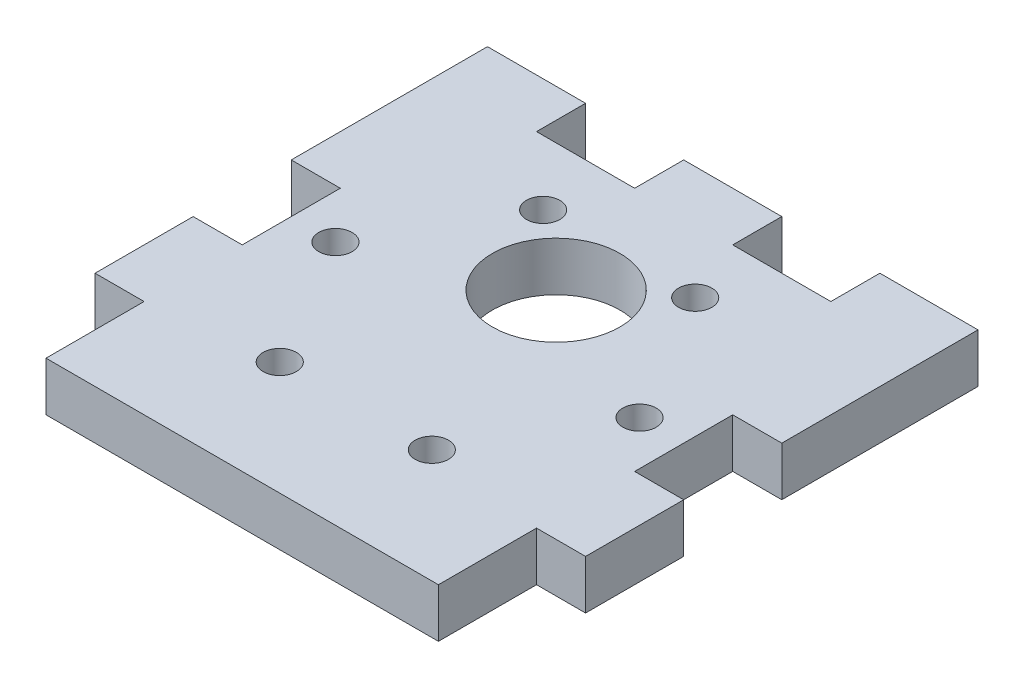
ISO-10303-21;
HEADER;
FILE_DESCRIPTION(('STEP AP214'),'2;1');
FILE_NAME('part.step','',(''),(''),'','','');
FILE_SCHEMA(('AUTOMOTIVE_DESIGN { 1 0 10303 214 1 1 1 1 }'));
ENDSEC;
DATA;
#1=APPLICATION_CONTEXT('core data for automotive mechanical design processes');
#2=APPLICATION_PROTOCOL_DEFINITION('international standard','automotive_design',2000,#1);
#3=PRODUCT_CONTEXT('',#1,'mechanical');
#4=PRODUCT('Part','Part','',(#3));
#5=PRODUCT_RELATED_PRODUCT_CATEGORY('part','',(#4));
#6=PRODUCT_DEFINITION_FORMATION('','',#4);
#7=PRODUCT_DEFINITION_CONTEXT('part definition',#1,'design');
#8=PRODUCT_DEFINITION('design','',#6,#7);
#9=PRODUCT_DEFINITION_SHAPE('','',#8);
#10=(LENGTH_UNIT() NAMED_UNIT(*) SI_UNIT(.MILLI.,.METRE.));
#11=(NAMED_UNIT(*) PLANE_ANGLE_UNIT() SI_UNIT($,.RADIAN.));
#12=(NAMED_UNIT(*) SI_UNIT($,.STERADIAN.) SOLID_ANGLE_UNIT());
#13=UNCERTAINTY_MEASURE_WITH_UNIT(LENGTH_MEASURE(1.E-05),#10,'distance_accuracy_value','');
#14=(GEOMETRIC_REPRESENTATION_CONTEXT(3) GLOBAL_UNCERTAINTY_ASSIGNED_CONTEXT((#13)) GLOBAL_UNIT_ASSIGNED_CONTEXT((#10,
#11,#12)) REPRESENTATION_CONTEXT('',''));
#15=CARTESIAN_POINT('',(0.,0.,0.));
#16=DIRECTION('',(0.,0.,1.));
#17=DIRECTION('',(1.,0.,0.));
#18=AXIS2_PLACEMENT_3D('',#15,#16,#17);
#19=CARTESIAN_POINT('',(25.,5.,25.));
#20=DIRECTION('',(-1.,0.,0.));
#21=DIRECTION('',(0.,0.,1.));
#22=AXIS2_PLACEMENT_3D('',#19,#20,#21);
#23=PLANE('',#22);
#24=DIRECTION('',(0.,0.,-1.));
#25=VECTOR('',#24,1.);
#26=CARTESIAN_POINT('',(25.,0.,25.));
#27=LINE('',#26,#25);
#28=CARTESIAN_POINT('',(25.,0.,15.));
#29=VERTEX_POINT('',#28);
#30=CARTESIAN_POINT('',(25.,0.,5.));
#31=VERTEX_POINT('',#30);
#32=EDGE_CURVE('E403',#29,#31,#27,.T.);
#33=ORIENTED_EDGE('',*,*,#32,.T.);
#34=DIRECTION('',(0.,1.,0.));
#35=VECTOR('',#34,1.);
#36=CARTESIAN_POINT('',(25.,0.,5.));
#37=LINE('',#36,#35);
#38=CARTESIAN_POINT('',(25.,5.,5.));
#39=VERTEX_POINT('',#38);
#40=EDGE_CURVE('E226',#31,#39,#37,.T.);
#41=ORIENTED_EDGE('',*,*,#40,.T.);
#42=DIRECTION('',(0.,0.,-1.));
#43=VECTOR('',#42,1.);
#44=CARTESIAN_POINT('',(25.,5.,25.));
#45=LINE('',#44,#43);
#46=CARTESIAN_POINT('',(25.,5.,15.));
#47=VERTEX_POINT('',#46);
#48=EDGE_CURVE('E387',#47,#39,#45,.T.);
#49=ORIENTED_EDGE('',*,*,#48,.F.);
#50=DIRECTION('',(0.,1.,0.));
#51=VECTOR('',#50,1.);
#52=CARTESIAN_POINT('',(25.,0.,15.));
#53=LINE('',#52,#51);
#54=EDGE_CURVE('E238',#29,#47,#53,.T.);
#55=ORIENTED_EDGE('',*,*,#54,.F.);
#56=EDGE_LOOP('',(#33,#41,#49,#55));
#57=FACE_BOUND('',#56,.T.);
#58=ADVANCED_FACE('F35',(#57),#23,.F.);
#59=CARTESIAN_POINT('',(-25.,5.,25.));
#60=DIRECTION('',(1.,0.,0.));
#61=DIRECTION('',(0.,0.,-1.));
#62=AXIS2_PLACEMENT_3D('',#59,#60,#61);
#63=PLANE('',#62);
#64=DIRECTION('',(0.,0.,1.));
#65=VECTOR('',#64,1.);
#66=CARTESIAN_POINT('',(-25.,0.,25.));
#67=LINE('',#66,#65);
#68=CARTESIAN_POINT('',(-25.,0.,-25.));
#69=VERTEX_POINT('',#68);
#70=CARTESIAN_POINT('',(-25.,0.,-4.99999999999999));
#71=VERTEX_POINT('',#70);
#72=EDGE_CURVE('E412',#69,#71,#67,.T.);
#73=ORIENTED_EDGE('',*,*,#72,.T.);
#74=DIRECTION('',(0.,1.,0.));
#75=VECTOR('',#74,1.);
#76=CARTESIAN_POINT('',(-25.,0.,-4.99999999999999));
#77=LINE('',#76,#75);
#78=CARTESIAN_POINT('',(-25.,5.,-4.99999999999999));
#79=VERTEX_POINT('',#78);
#80=EDGE_CURVE('E265',#71,#79,#77,.T.);
#81=ORIENTED_EDGE('',*,*,#80,.T.);
#82=DIRECTION('',(0.,0.,1.));
#83=VECTOR('',#82,1.);
#84=CARTESIAN_POINT('',(-25.,5.,25.));
#85=LINE('',#84,#83);
#86=CARTESIAN_POINT('',(-25.,5.,-25.));
#87=VERTEX_POINT('',#86);
#88=EDGE_CURVE('E397',#87,#79,#85,.T.);
#89=ORIENTED_EDGE('',*,*,#88,.F.);
#90=DIRECTION('',(0.,-1.,0.));
#91=VECTOR('',#90,1.);
#92=CARTESIAN_POINT('',(-25.,5.,-25.));
#93=LINE('',#92,#91);
#94=EDGE_CURVE('E43',#87,#69,#93,.T.);
#95=ORIENTED_EDGE('',*,*,#94,.T.);
#96=EDGE_LOOP('',(#73,#81,#89,#95));
#97=FACE_BOUND('',#96,.T.);
#98=ADVANCED_FACE('F422',(#97),#63,.F.);
#99=CARTESIAN_POINT('',(-25.,5.,-25.));
#100=DIRECTION('',(0.,0.,1.));
#101=DIRECTION('',(1.,0.,0.));
#102=AXIS2_PLACEMENT_3D('',#99,#100,#101);
#103=PLANE('',#102);
#104=DIRECTION('',(-1.,0.,0.));
#105=VECTOR('',#104,1.);
#106=CARTESIAN_POINT('',(-25.,5.,-25.));
#107=LINE('',#106,#105);
#108=CARTESIAN_POINT('',(5.,5.,-25.));
#109=VERTEX_POINT('',#108);
#110=CARTESIAN_POINT('',(-5.,5.,-25.));
#111=VERTEX_POINT('',#110);
#112=EDGE_CURVE('E396',#109,#111,#107,.T.);
#113=ORIENTED_EDGE('',*,*,#112,.F.);
#114=DIRECTION('',(0.,1.,0.));
#115=VECTOR('',#114,1.);
#116=CARTESIAN_POINT('',(5.,0.,-25.));
#117=LINE('',#116,#115);
#118=CARTESIAN_POINT('',(5.,0.,-25.));
#119=VERTEX_POINT('',#118);
#120=EDGE_CURVE('E310',#119,#109,#117,.T.);
#121=ORIENTED_EDGE('',*,*,#120,.F.);
#122=DIRECTION('',(-1.,0.,0.));
#123=VECTOR('',#122,1.);
#124=CARTESIAN_POINT('',(-25.,0.,-25.));
#125=LINE('',#124,#123);
#126=CARTESIAN_POINT('',(-5.,0.,-25.));
#127=VERTEX_POINT('',#126);
#128=EDGE_CURVE('E411',#119,#127,#125,.T.);
#129=ORIENTED_EDGE('',*,*,#128,.T.);
#130=DIRECTION('',(0.,1.,0.));
#131=VECTOR('',#130,1.);
#132=CARTESIAN_POINT('',(-5.,0.,-25.));
#133=LINE('',#132,#131);
#134=EDGE_CURVE('E340',#127,#111,#133,.T.);
#135=ORIENTED_EDGE('',*,*,#134,.T.);
#136=EDGE_LOOP('',(#113,#121,#129,#135));
#137=FACE_BOUND('',#136,.T.);
#138=ADVANCED_FACE('F448',(#137),#103,.F.);
#139=CARTESIAN_POINT('',(-15.,5.,-25.));
#140=VERTEX_POINT('',#139);
#141=EDGE_CURVE('E390',#140,#87,#107,.T.);
#142=ORIENTED_EDGE('',*,*,#141,.F.);
#143=DIRECTION('',(0.,1.,0.));
#144=VECTOR('',#143,1.);
#145=CARTESIAN_POINT('',(-15.,0.,-25.));
#146=LINE('',#145,#144);
#147=CARTESIAN_POINT('',(-15.,0.,-25.));
#148=VERTEX_POINT('',#147);
#149=EDGE_CURVE('E337',#148,#140,#146,.T.);
#150=ORIENTED_EDGE('',*,*,#149,.F.);
#151=EDGE_CURVE('E406',#148,#69,#125,.T.);
#152=ORIENTED_EDGE('',*,*,#151,.T.);
#153=ORIENTED_EDGE('',*,*,#94,.F.);
#154=EDGE_LOOP('',(#142,#150,#152,#153));
#155=FACE_BOUND('',#154,.T.);
#156=ADVANCED_FACE('F450',(#155),#103,.F.);
#157=CARTESIAN_POINT('',(0.,5.,0.));
#158=DIRECTION('',(0.,-1.,0.));
#159=DIRECTION('',(0.,0.,-1.));
#160=AXIS2_PLACEMENT_3D('',#157,#158,#159);
#161=PLANE('',#160);
#162=ORIENTED_EDGE('',*,*,#48,.T.);
#163=DIRECTION('',(1.,0.,0.));
#164=VECTOR('',#163,1.);
#165=CARTESIAN_POINT('',(25.,5.,5.));
#166=LINE('',#165,#164);
#167=CARTESIAN_POINT('',(20.,5.,5.));
#168=VERTEX_POINT('',#167);
#169=EDGE_CURVE('E218',#168,#39,#166,.T.);
#170=ORIENTED_EDGE('',*,*,#169,.F.);
#171=DIRECTION('',(0.,0.,1.));
#172=VECTOR('',#171,1.);
#173=CARTESIAN_POINT('',(20.,5.,5.));
#174=LINE('',#173,#172);
#175=CARTESIAN_POINT('',(20.,5.,-5.));
#176=VERTEX_POINT('',#175);
#177=EDGE_CURVE('E220',#176,#168,#174,.T.);
#178=ORIENTED_EDGE('',*,*,#177,.F.);
#179=DIRECTION('',(-1.,0.,0.));
#180=VECTOR('',#179,1.);
#181=CARTESIAN_POINT('',(25.,5.,-5.));
#182=LINE('',#181,#180);
#183=CARTESIAN_POINT('',(25.,5.,-5.));
#184=VERTEX_POINT('',#183);
#185=EDGE_CURVE('E198',#184,#176,#182,.T.);
#186=ORIENTED_EDGE('',*,*,#185,.F.);
#187=CARTESIAN_POINT('',(25.,5.,-25.));
#188=VERTEX_POINT('',#187);
#189=EDGE_CURVE('E391',#184,#188,#45,.T.);
#190=ORIENTED_EDGE('',*,*,#189,.T.);
#191=CARTESIAN_POINT('',(15.,5.,-25.));
#192=VERTEX_POINT('',#191);
#193=EDGE_CURVE('E392',#188,#192,#107,.T.);
#194=ORIENTED_EDGE('',*,*,#193,.T.);
#195=DIRECTION('',(0.,0.,-1.));
#196=VECTOR('',#195,1.);
#197=CARTESIAN_POINT('',(15.,5.,-25.));
#198=LINE('',#197,#196);
#199=CARTESIAN_POINT('',(15.,5.,-20.));
#200=VERTEX_POINT('',#199);
#201=EDGE_CURVE('E297',#200,#192,#198,.T.);
#202=ORIENTED_EDGE('',*,*,#201,.F.);
#203=DIRECTION('',(1.,0.,0.));
#204=VECTOR('',#203,1.);
#205=CARTESIAN_POINT('',(5.,5.,-20.));
#206=LINE('',#205,#204);
#207=CARTESIAN_POINT('',(5.,5.,-20.));
#208=VERTEX_POINT('',#207);
#209=EDGE_CURVE('E306',#208,#200,#206,.T.);
#210=ORIENTED_EDGE('',*,*,#209,.F.);
#211=DIRECTION('',(0.,0.,1.));
#212=VECTOR('',#211,1.);
#213=CARTESIAN_POINT('',(5.,5.,-25.));
#214=LINE('',#213,#212);
#215=EDGE_CURVE('E289',#109,#208,#214,.T.);
#216=ORIENTED_EDGE('',*,*,#215,.F.);
#217=ORIENTED_EDGE('',*,*,#112,.T.);
#218=DIRECTION('',(0.,0.,-1.));
#219=VECTOR('',#218,1.);
#220=CARTESIAN_POINT('',(-5.,5.,-25.));
#221=LINE('',#220,#219);
#222=CARTESIAN_POINT('',(-5.,5.,-20.));
#223=VERTEX_POINT('',#222);
#224=EDGE_CURVE('E323',#223,#111,#221,.T.);
#225=ORIENTED_EDGE('',*,*,#224,.F.);
#226=DIRECTION('',(1.,0.,0.));
#227=VECTOR('',#226,1.);
#228=CARTESIAN_POINT('',(-15.,5.,-20.));
#229=LINE('',#228,#227);
#230=CARTESIAN_POINT('',(-15.,5.,-20.));
#231=VERTEX_POINT('',#230);
#232=EDGE_CURVE('E332',#231,#223,#229,.T.);
#233=ORIENTED_EDGE('',*,*,#232,.F.);
#234=DIRECTION('',(0.,0.,1.));
#235=VECTOR('',#234,1.);
#236=CARTESIAN_POINT('',(-15.,5.,-25.));
#237=LINE('',#236,#235);
#238=EDGE_CURVE('E312',#140,#231,#237,.T.);
#239=ORIENTED_EDGE('',*,*,#238,.F.);
#240=ORIENTED_EDGE('',*,*,#141,.T.);
#241=ORIENTED_EDGE('',*,*,#88,.T.);
#242=DIRECTION('',(-1.,0.,0.));
#243=VECTOR('',#242,1.);
#244=CARTESIAN_POINT('',(-25.,5.,-4.99999999999999));
#245=LINE('',#244,#243);
#246=CARTESIAN_POINT('',(-20.,5.,-4.99999999999999));
#247=VERTEX_POINT('',#246);
#248=EDGE_CURVE('E252',#247,#79,#245,.T.);
#249=ORIENTED_EDGE('',*,*,#248,.F.);
#250=DIRECTION('',(0.,0.,-1.));
#251=VECTOR('',#250,1.);
#252=CARTESIAN_POINT('',(-20.,5.,5.));
#253=LINE('',#252,#251);
#254=CARTESIAN_POINT('',(-20.,5.,5.));
#255=VERTEX_POINT('',#254);
#256=EDGE_CURVE('E261',#255,#247,#253,.T.);
#257=ORIENTED_EDGE('',*,*,#256,.F.);
#258=DIRECTION('',(1.,0.,0.));
#259=VECTOR('',#258,1.);
#260=CARTESIAN_POINT('',(-25.,5.,5.));
#261=LINE('',#260,#259);
#262=CARTESIAN_POINT('',(-25.,5.,5.));
#263=VERTEX_POINT('',#262);
#264=EDGE_CURVE('E244',#263,#255,#261,.T.);
#265=ORIENTED_EDGE('',*,*,#264,.F.);
#266=CARTESIAN_POINT('',(-25.,5.,15.));
#267=VERTEX_POINT('',#266);
#268=EDGE_CURVE('E395',#263,#267,#85,.T.);
#269=ORIENTED_EDGE('',*,*,#268,.T.);
#270=DIRECTION('',(-1.,0.,0.));
#271=VECTOR('',#270,1.);
#272=CARTESIAN_POINT('',(-25.,5.,15.));
#273=LINE('',#272,#271);
#274=CARTESIAN_POINT('',(-20.,5.,15.));
#275=VERTEX_POINT('',#274);
#276=EDGE_CURVE('E278',#275,#267,#273,.T.);
#277=ORIENTED_EDGE('',*,*,#276,.F.);
#278=DIRECTION('',(0.,0.,-1.));
#279=VECTOR('',#278,1.);
#280=CARTESIAN_POINT('',(-20.,5.,25.));
#281=LINE('',#280,#279);
#282=CARTESIAN_POINT('',(-20.,5.,25.));
#283=VERTEX_POINT('',#282);
#284=EDGE_CURVE('E268',#283,#275,#281,.T.);
#285=ORIENTED_EDGE('',*,*,#284,.F.);
#286=DIRECTION('',(1.,0.,0.));
#287=VECTOR('',#286,1.);
#288=CARTESIAN_POINT('',(-25.,5.,25.));
#289=LINE('',#288,#287);
#290=CARTESIAN_POINT('',(20.,5.,25.));
#291=VERTEX_POINT('',#290);
#292=EDGE_CURVE('E400',#283,#291,#289,.T.);
#293=ORIENTED_EDGE('',*,*,#292,.T.);
#294=DIRECTION('',(0.,0.,1.));
#295=VECTOR('',#294,1.);
#296=CARTESIAN_POINT('',(20.,5.,25.));
#297=LINE('',#296,#295);
#298=CARTESIAN_POINT('',(20.,5.,15.));
#299=VERTEX_POINT('',#298);
#300=EDGE_CURVE('E58',#299,#291,#297,.T.);
#301=ORIENTED_EDGE('',*,*,#300,.F.);
#302=DIRECTION('',(-1.,0.,0.));
#303=VECTOR('',#302,1.);
#304=CARTESIAN_POINT('',(25.,5.,15.));
#305=LINE('',#304,#303);
#306=EDGE_CURVE('E229',#47,#299,#305,.T.);
#307=ORIENTED_EDGE('',*,*,#306,.F.);
#308=EDGE_LOOP('',(#162,#170,#178,#186,#190,#194,#202,#210,#216,#217,#225,#233,#239,#240,#241,
#249,#257,#265,#269,#277,#285,#293,#301,#307));
#309=FACE_BOUND('',#308,.T.);
#310=CARTESIAN_POINT('',(-15.5,5.,0.));
#311=DIRECTION('',(0.,1.,0.));
#312=DIRECTION('',(0.,0.,1.));
#313=AXIS2_PLACEMENT_3D('',#310,#311,#312);
#314=CIRCLE('',#313,1.7);
#315=CARTESIAN_POINT('',(-15.5,5.,1.7));
#316=VERTEX_POINT('',#315);
#317=EDGE_CURVE('E382',#316,#316,#314,.T.);
#318=ORIENTED_EDGE('',*,*,#317,.F.);
#319=EDGE_LOOP('',(#318));
#320=FACE_BOUND('',#319,.T.);
#321=CARTESIAN_POINT('',(0.,5.,-7.));
#322=DIRECTION('',(0.,1.,0.));
#323=DIRECTION('',(0.,0.,1.));
#324=AXIS2_PLACEMENT_3D('',#321,#322,#323);
#325=CIRCLE('',#324,6.5);
#326=CARTESIAN_POINT('',(0.,5.,-0.5));
#327=VERTEX_POINT('',#326);
#328=EDGE_CURVE('E376',#327,#327,#325,.T.);
#329=ORIENTED_EDGE('',*,*,#328,.F.);
#330=EDGE_LOOP('',(#329));
#331=FACE_BOUND('',#330,.T.);
#332=CARTESIAN_POINT('',(-7.74999999999997,5.,-13.4233937586588));
#333=DIRECTION('',(0.,1.,0.));
#334=DIRECTION('',(0.,0.,1.));
#335=AXIS2_PLACEMENT_3D('',#332,#333,#334);
#336=CIRCLE('',#335,1.7);
#337=CARTESIAN_POINT('',(-7.74999999999997,5.,-11.7233937586588));
#338=VERTEX_POINT('',#337);
#339=EDGE_CURVE('E370',#338,#338,#336,.T.);
#340=ORIENTED_EDGE('',*,*,#339,.F.);
#341=EDGE_LOOP('',(#340));
#342=FACE_BOUND('',#341,.T.);
#343=CARTESIAN_POINT('',(7.75000000000006,5.,-13.4233937586588));
#344=DIRECTION('',(0.,1.,0.));
#345=DIRECTION('',(0.,0.,1.));
#346=AXIS2_PLACEMENT_3D('',#343,#344,#345);
#347=CIRCLE('',#346,1.7);
#348=CARTESIAN_POINT('',(7.75000000000006,5.,-11.7233937586588));
#349=VERTEX_POINT('',#348);
#350=EDGE_CURVE('E364',#349,#349,#347,.T.);
#351=ORIENTED_EDGE('',*,*,#350,.F.);
#352=EDGE_LOOP('',(#351));
#353=FACE_BOUND('',#352,.T.);
#354=CARTESIAN_POINT('',(15.5,5.,1.08235921504137E-13));
#355=DIRECTION('',(0.,1.,0.));
#356=DIRECTION('',(0.,0.,1.));
#357=AXIS2_PLACEMENT_3D('',#354,#355,#356);
#358=CIRCLE('',#357,1.7);
#359=CARTESIAN_POINT('',(15.5,5.,1.70000000000011));
#360=VERTEX_POINT('',#359);
#361=EDGE_CURVE('E358',#360,#360,#358,.T.);
#362=ORIENTED_EDGE('',*,*,#361,.F.);
#363=EDGE_LOOP('',(#362));
#364=FACE_BOUND('',#363,.T.);
#365=CARTESIAN_POINT('',(7.74999999999987,5.,13.4233937586589));
#366=DIRECTION('',(0.,1.,0.));
#367=DIRECTION('',(0.,0.,1.));
#368=AXIS2_PLACEMENT_3D('',#365,#366,#367);
#369=CIRCLE('',#368,1.7);
#370=CARTESIAN_POINT('',(7.74999999999987,5.,15.1233937586589));
#371=VERTEX_POINT('',#370);
#372=EDGE_CURVE('E352',#371,#371,#369,.T.);
#373=ORIENTED_EDGE('',*,*,#372,.F.);
#374=EDGE_LOOP('',(#373));
#375=FACE_BOUND('',#374,.T.);
#376=CARTESIAN_POINT('',(-7.75000000000016,5.,13.4233937586587));
#377=DIRECTION('',(0.,1.,0.));
#378=DIRECTION('',(0.,0.,1.));
#379=AXIS2_PLACEMENT_3D('',#376,#377,#378);
#380=CIRCLE('',#379,1.7);
#381=CARTESIAN_POINT('',(-7.75000000000016,5.,15.1233937586587));
#382=VERTEX_POINT('',#381);
#383=EDGE_CURVE('E346',#382,#382,#380,.T.);
#384=ORIENTED_EDGE('',*,*,#383,.F.);
#385=EDGE_LOOP('',(#384));
#386=FACE_BOUND('',#385,.T.);
#387=ADVANCED_FACE('F432',(#309,#320,#331,#342,#353,#364,#375,#386),#161,.F.);
#388=CARTESIAN_POINT('',(0.,0.,0.));
#389=DIRECTION('',(0.,-1.,0.));
#390=DIRECTION('',(0.,0.,-1.));
#391=AXIS2_PLACEMENT_3D('',#388,#389,#390);
#392=PLANE('',#391);
#393=DIRECTION('',(1.,0.,0.));
#394=VECTOR('',#393,1.);
#395=CARTESIAN_POINT('',(25.,0.,5.));
#396=LINE('',#395,#394);
#397=CARTESIAN_POINT('',(20.,0.,5.));
#398=VERTEX_POINT('',#397);
#399=EDGE_CURVE('E211',#398,#31,#396,.T.);
#400=ORIENTED_EDGE('',*,*,#399,.T.);
#401=ORIENTED_EDGE('',*,*,#32,.F.);
#402=DIRECTION('',(-1.,0.,0.));
#403=VECTOR('',#402,1.);
#404=CARTESIAN_POINT('',(25.,0.,15.));
#405=LINE('',#404,#403);
#406=CARTESIAN_POINT('',(20.,0.,15.));
#407=VERTEX_POINT('',#406);
#408=EDGE_CURVE('E232',#29,#407,#405,.T.);
#409=ORIENTED_EDGE('',*,*,#408,.T.);
#410=DIRECTION('',(0.,0.,1.));
#411=VECTOR('',#410,1.);
#412=CARTESIAN_POINT('',(20.,0.,25.));
#413=LINE('',#412,#411);
#414=CARTESIAN_POINT('',(20.,0.,25.));
#415=VERTEX_POINT('',#414);
#416=EDGE_CURVE('E235',#407,#415,#413,.T.);
#417=ORIENTED_EDGE('',*,*,#416,.T.);
#418=DIRECTION('',(1.,0.,0.));
#419=VECTOR('',#418,1.);
#420=CARTESIAN_POINT('',(-25.,0.,25.));
#421=LINE('',#420,#419);
#422=CARTESIAN_POINT('',(-20.,0.,25.));
#423=VERTEX_POINT('',#422);
#424=EDGE_CURVE('E415',#423,#415,#421,.T.);
#425=ORIENTED_EDGE('',*,*,#424,.F.);
#426=DIRECTION('',(0.,0.,-1.));
#427=VECTOR('',#426,1.);
#428=CARTESIAN_POINT('',(-20.,0.,25.));
#429=LINE('',#428,#427);
#430=CARTESIAN_POINT('',(-20.,0.,15.));
#431=VERTEX_POINT('',#430);
#432=EDGE_CURVE('E274',#423,#431,#429,.T.);
#433=ORIENTED_EDGE('',*,*,#432,.T.);
#434=DIRECTION('',(-1.,0.,0.));
#435=VECTOR('',#434,1.);
#436=CARTESIAN_POINT('',(-25.,0.,15.));
#437=LINE('',#436,#435);
#438=CARTESIAN_POINT('',(-25.,0.,15.));
#439=VERTEX_POINT('',#438);
#440=EDGE_CURVE('E277',#431,#439,#437,.T.);
#441=ORIENTED_EDGE('',*,*,#440,.T.);
#442=CARTESIAN_POINT('',(-25.,0.,5.));
#443=VERTEX_POINT('',#442);
#444=EDGE_CURVE('E410',#443,#439,#67,.T.);
#445=ORIENTED_EDGE('',*,*,#444,.F.);
#446=DIRECTION('',(1.,0.,0.));
#447=VECTOR('',#446,1.);
#448=CARTESIAN_POINT('',(-25.,0.,5.));
#449=LINE('',#448,#447);
#450=CARTESIAN_POINT('',(-20.,0.,5.));
#451=VERTEX_POINT('',#450);
#452=EDGE_CURVE('E248',#443,#451,#449,.T.);
#453=ORIENTED_EDGE('',*,*,#452,.T.);
#454=DIRECTION('',(0.,0.,-1.));
#455=VECTOR('',#454,1.);
#456=CARTESIAN_POINT('',(-20.,0.,5.));
#457=LINE('',#456,#455);
#458=CARTESIAN_POINT('',(-20.,0.,-4.99999999999999));
#459=VERTEX_POINT('',#458);
#460=EDGE_CURVE('E251',#451,#459,#457,.T.);
#461=ORIENTED_EDGE('',*,*,#460,.T.);
#462=DIRECTION('',(-1.,0.,0.));
#463=VECTOR('',#462,1.);
#464=CARTESIAN_POINT('',(-25.,0.,-4.99999999999999));
#465=LINE('',#464,#463);
#466=EDGE_CURVE('E255',#459,#71,#465,.T.);
#467=ORIENTED_EDGE('',*,*,#466,.T.);
#468=ORIENTED_EDGE('',*,*,#72,.F.);
#469=ORIENTED_EDGE('',*,*,#151,.F.);
#470=DIRECTION('',(0.,0.,1.));
#471=VECTOR('',#470,1.);
#472=CARTESIAN_POINT('',(-15.,0.,-25.));
#473=LINE('',#472,#471);
#474=CARTESIAN_POINT('',(-15.,0.,-20.));
#475=VERTEX_POINT('',#474);
#476=EDGE_CURVE('E319',#148,#475,#473,.T.);
#477=ORIENTED_EDGE('',*,*,#476,.T.);
#478=DIRECTION('',(1.,0.,0.));
#479=VECTOR('',#478,1.);
#480=CARTESIAN_POINT('',(-15.,0.,-20.));
#481=LINE('',#480,#479);
#482=CARTESIAN_POINT('',(-5.,0.,-20.));
#483=VERTEX_POINT('',#482);
#484=EDGE_CURVE('E322',#475,#483,#481,.T.);
#485=ORIENTED_EDGE('',*,*,#484,.T.);
#486=DIRECTION('',(0.,0.,-1.));
#487=VECTOR('',#486,1.);
#488=CARTESIAN_POINT('',(-5.,0.,-25.));
#489=LINE('',#488,#487);
#490=EDGE_CURVE('E326',#483,#127,#489,.T.);
#491=ORIENTED_EDGE('',*,*,#490,.T.);
#492=ORIENTED_EDGE('',*,*,#128,.F.);
#493=DIRECTION('',(0.,0.,1.));
#494=VECTOR('',#493,1.);
#495=CARTESIAN_POINT('',(5.,0.,-25.));
#496=LINE('',#495,#494);
#497=CARTESIAN_POINT('',(5.,0.,-20.));
#498=VERTEX_POINT('',#497);
#499=EDGE_CURVE('E293',#119,#498,#496,.T.);
#500=ORIENTED_EDGE('',*,*,#499,.T.);
#501=DIRECTION('',(1.,0.,0.));
#502=VECTOR('',#501,1.);
#503=CARTESIAN_POINT('',(5.,0.,-20.));
#504=LINE('',#503,#502);
#505=CARTESIAN_POINT('',(15.,0.,-20.));
#506=VERTEX_POINT('',#505);
#507=EDGE_CURVE('E296',#498,#506,#504,.T.);
#508=ORIENTED_EDGE('',*,*,#507,.T.);
#509=DIRECTION('',(0.,0.,-1.));
#510=VECTOR('',#509,1.);
#511=CARTESIAN_POINT('',(15.,0.,-25.));
#512=LINE('',#511,#510);
#513=CARTESIAN_POINT('',(15.,0.,-25.));
#514=VERTEX_POINT('',#513);
#515=EDGE_CURVE('E300',#506,#514,#512,.T.);
#516=ORIENTED_EDGE('',*,*,#515,.T.);
#517=CARTESIAN_POINT('',(25.,0.,-25.));
#518=VERTEX_POINT('',#517);
#519=EDGE_CURVE('E407',#518,#514,#125,.T.);
#520=ORIENTED_EDGE('',*,*,#519,.F.);
#521=CARTESIAN_POINT('',(25.,0.,-5.));
#522=VERTEX_POINT('',#521);
#523=EDGE_CURVE('E217',#522,#518,#27,.T.);
#524=ORIENTED_EDGE('',*,*,#523,.F.);
#525=DIRECTION('',(-1.,0.,0.));
#526=VECTOR('',#525,1.);
#527=CARTESIAN_POINT('',(25.,0.,-5.));
#528=LINE('',#527,#526);
#529=CARTESIAN_POINT('',(20.,0.,-5.));
#530=VERTEX_POINT('',#529);
#531=EDGE_CURVE('E50',#522,#530,#528,.T.);
#532=ORIENTED_EDGE('',*,*,#531,.T.);
#533=DIRECTION('',(0.,0.,1.));
#534=VECTOR('',#533,1.);
#535=CARTESIAN_POINT('',(20.,0.,5.));
#536=LINE('',#535,#534);
#537=EDGE_CURVE('E206',#530,#398,#536,.T.);
#538=ORIENTED_EDGE('',*,*,#537,.T.);
#539=EDGE_LOOP('',(#400,#401,#409,#417,#425,#433,#441,#445,#453,#461,#467,#468,#469,#477,#485,
#491,#492,#500,#508,#516,#520,#524,#532,#538));
#540=FACE_BOUND('',#539,.T.);
#541=CARTESIAN_POINT('',(7.74999999999987,0.,13.4233937586589));
#542=DIRECTION('',(0.,1.,0.));
#543=DIRECTION('',(0.,0.,1.));
#544=AXIS2_PLACEMENT_3D('',#541,#542,#543);
#545=CIRCLE('',#544,1.7);
#546=CARTESIAN_POINT('',(7.74999999999987,0.,15.1233937586589));
#547=VERTEX_POINT('',#546);
#548=EDGE_CURVE('E349',#547,#547,#545,.T.);
#549=ORIENTED_EDGE('',*,*,#548,.T.);
#550=EDGE_LOOP('',(#549));
#551=FACE_BOUND('',#550,.T.);
#552=CARTESIAN_POINT('',(7.75000000000006,0.,-13.4233937586588));
#553=DIRECTION('',(0.,1.,0.));
#554=DIRECTION('',(0.,0.,1.));
#555=AXIS2_PLACEMENT_3D('',#552,#553,#554);
#556=CIRCLE('',#555,1.7);
#557=CARTESIAN_POINT('',(7.75000000000006,0.,-11.7233937586588));
#558=VERTEX_POINT('',#557);
#559=EDGE_CURVE('E361',#558,#558,#556,.T.);
#560=ORIENTED_EDGE('',*,*,#559,.T.);
#561=EDGE_LOOP('',(#560));
#562=FACE_BOUND('',#561,.T.);
#563=CARTESIAN_POINT('',(0.,0.,-7.));
#564=DIRECTION('',(0.,1.,0.));
#565=DIRECTION('',(0.,0.,1.));
#566=AXIS2_PLACEMENT_3D('',#563,#564,#565);
#567=CIRCLE('',#566,6.5);
#568=CARTESIAN_POINT('',(0.,0.,-0.5));
#569=VERTEX_POINT('',#568);
#570=EDGE_CURVE('E373',#569,#569,#567,.T.);
#571=ORIENTED_EDGE('',*,*,#570,.T.);
#572=EDGE_LOOP('',(#571));
#573=FACE_BOUND('',#572,.T.);
#574=CARTESIAN_POINT('',(-15.5,0.,0.));
#575=DIRECTION('',(0.,1.,0.));
#576=DIRECTION('',(0.,0.,1.));
#577=AXIS2_PLACEMENT_3D('',#574,#575,#576);
#578=CIRCLE('',#577,1.7);
#579=CARTESIAN_POINT('',(-15.5,0.,1.7));
#580=VERTEX_POINT('',#579);
#581=EDGE_CURVE('E379',#580,#580,#578,.T.);
#582=ORIENTED_EDGE('',*,*,#581,.T.);
#583=EDGE_LOOP('',(#582));
#584=FACE_BOUND('',#583,.T.);
#585=CARTESIAN_POINT('',(-7.74999999999997,0.,-13.4233937586588));
#586=DIRECTION('',(0.,1.,0.));
#587=DIRECTION('',(0.,0.,1.));
#588=AXIS2_PLACEMENT_3D('',#585,#586,#587);
#589=CIRCLE('',#588,1.7);
#590=CARTESIAN_POINT('',(-7.74999999999997,0.,-11.7233937586588));
#591=VERTEX_POINT('',#590);
#592=EDGE_CURVE('E367',#591,#591,#589,.T.);
#593=ORIENTED_EDGE('',*,*,#592,.T.);
#594=EDGE_LOOP('',(#593));
#595=FACE_BOUND('',#594,.T.);
#596=CARTESIAN_POINT('',(15.5,0.,1.08235921504137E-13));
#597=DIRECTION('',(0.,1.,0.));
#598=DIRECTION('',(0.,0.,1.));
#599=AXIS2_PLACEMENT_3D('',#596,#597,#598);
#600=CIRCLE('',#599,1.7);
#601=CARTESIAN_POINT('',(15.5,0.,1.70000000000011));
#602=VERTEX_POINT('',#601);
#603=EDGE_CURVE('E355',#602,#602,#600,.T.);
#604=ORIENTED_EDGE('',*,*,#603,.T.);
#605=EDGE_LOOP('',(#604));
#606=FACE_BOUND('',#605,.T.);
#607=CARTESIAN_POINT('',(-7.75000000000016,0.,13.4233937586587));
#608=DIRECTION('',(0.,1.,0.));
#609=DIRECTION('',(0.,0.,1.));
#610=AXIS2_PLACEMENT_3D('',#607,#608,#609);
#611=CIRCLE('',#610,1.7);
#612=CARTESIAN_POINT('',(-7.75000000000016,0.,15.1233937586587));
#613=VERTEX_POINT('',#612);
#614=EDGE_CURVE('E339',#613,#613,#611,.T.);
#615=ORIENTED_EDGE('',*,*,#614,.T.);
#616=EDGE_LOOP('',(#615));
#617=FACE_BOUND('',#616,.T.);
#618=ADVANCED_FACE('F214',(#540,#551,#562,#573,#584,#595,#606,#617),#392,.T.);
#619=ORIENTED_EDGE('',*,*,#189,.F.);
#620=DIRECTION('',(0.,1.,0.));
#621=VECTOR('',#620,1.);
#622=CARTESIAN_POINT('',(25.,0.,-5.));
#623=LINE('',#622,#621);
#624=EDGE_CURVE('E203',#522,#184,#623,.T.);
#625=ORIENTED_EDGE('',*,*,#624,.F.);
#626=ORIENTED_EDGE('',*,*,#523,.T.);
#627=DIRECTION('',(0.,-1.,0.));
#628=VECTOR('',#627,1.);
#629=CARTESIAN_POINT('',(25.,5.,-25.));
#630=LINE('',#629,#628);
#631=EDGE_CURVE('E11',#188,#518,#630,.T.);
#632=ORIENTED_EDGE('',*,*,#631,.F.);
#633=EDGE_LOOP('',(#619,#625,#626,#632));
#634=FACE_BOUND('',#633,.T.);
#635=ADVANCED_FACE('F37',(#634),#23,.F.);
#636=ORIENTED_EDGE('',*,*,#519,.T.);
#637=DIRECTION('',(0.,1.,0.));
#638=VECTOR('',#637,1.);
#639=CARTESIAN_POINT('',(15.,0.,-25.));
#640=LINE('',#639,#638);
#641=EDGE_CURVE('E313',#514,#192,#640,.T.);
#642=ORIENTED_EDGE('',*,*,#641,.T.);
#643=ORIENTED_EDGE('',*,*,#193,.F.);
#644=ORIENTED_EDGE('',*,*,#631,.T.);
#645=EDGE_LOOP('',(#636,#642,#643,#644));
#646=FACE_BOUND('',#645,.T.);
#647=ADVANCED_FACE('F476',(#646),#103,.F.);
#648=ORIENTED_EDGE('',*,*,#268,.F.);
#649=DIRECTION('',(0.,1.,0.));
#650=VECTOR('',#649,1.);
#651=CARTESIAN_POINT('',(-25.,0.,5.));
#652=LINE('',#651,#650);
#653=EDGE_CURVE('E258',#443,#263,#652,.T.);
#654=ORIENTED_EDGE('',*,*,#653,.F.);
#655=ORIENTED_EDGE('',*,*,#444,.T.);
#656=DIRECTION('',(0.,1.,0.));
#657=VECTOR('',#656,1.);
#658=CARTESIAN_POINT('',(-25.,0.,15.));
#659=LINE('',#658,#657);
#660=EDGE_CURVE('E286',#439,#267,#659,.T.);
#661=ORIENTED_EDGE('',*,*,#660,.T.);
#662=EDGE_LOOP('',(#648,#654,#655,#661));
#663=FACE_BOUND('',#662,.T.);
#664=ADVANCED_FACE('F474',(#663),#63,.F.);
#665=CARTESIAN_POINT('',(-25.,5.,25.));
#666=DIRECTION('',(0.,0.,-1.));
#667=DIRECTION('',(-1.,0.,0.));
#668=AXIS2_PLACEMENT_3D('',#665,#666,#667);
#669=PLANE('',#668);
#670=ORIENTED_EDGE('',*,*,#424,.T.);
#671=DIRECTION('',(0.,1.,0.));
#672=VECTOR('',#671,1.);
#673=CARTESIAN_POINT('',(20.,0.,25.));
#674=LINE('',#673,#672);
#675=EDGE_CURVE('E242',#415,#291,#674,.T.);
#676=ORIENTED_EDGE('',*,*,#675,.T.);
#677=ORIENTED_EDGE('',*,*,#292,.F.);
#678=DIRECTION('',(0.,1.,0.));
#679=VECTOR('',#678,1.);
#680=CARTESIAN_POINT('',(-20.,0.,25.));
#681=LINE('',#680,#679);
#682=EDGE_CURVE('E281',#423,#283,#681,.T.);
#683=ORIENTED_EDGE('',*,*,#682,.F.);
#684=EDGE_LOOP('',(#670,#676,#677,#683));
#685=FACE_BOUND('',#684,.T.);
#686=ADVANCED_FACE('F543',(#685),#669,.F.);
#687=CARTESIAN_POINT('',(-15.5,5.,0.));
#688=DIRECTION('',(0.,-1.,0.));
#689=DIRECTION('',(0.,0.,-1.));
#690=AXIS2_PLACEMENT_3D('',#687,#688,#689);
#691=CYLINDRICAL_SURFACE('',#690,1.7);
#692=ORIENTED_EDGE('',*,*,#317,.T.);
#693=EDGE_LOOP('',(#692));
#694=FACE_BOUND('',#693,.T.);
#695=ORIENTED_EDGE('',*,*,#581,.F.);
#696=EDGE_LOOP('',(#695));
#697=FACE_BOUND('',#696,.T.);
#698=ADVANCED_FACE('F558',(#694,#697),#691,.F.);
#699=CARTESIAN_POINT('',(0.,5.,-7.));
#700=DIRECTION('',(0.,-1.,0.));
#701=DIRECTION('',(0.,0.,-1.));
#702=AXIS2_PLACEMENT_3D('',#699,#700,#701);
#703=CYLINDRICAL_SURFACE('',#702,6.5);
#704=ORIENTED_EDGE('',*,*,#328,.T.);
#705=EDGE_LOOP('',(#704));
#706=FACE_BOUND('',#705,.T.);
#707=ORIENTED_EDGE('',*,*,#570,.F.);
#708=EDGE_LOOP('',(#707));
#709=FACE_BOUND('',#708,.T.);
#710=ADVANCED_FACE('F565',(#706,#709),#703,.F.);
#711=CARTESIAN_POINT('',(-7.74999999999997,5.,-13.4233937586588));
#712=DIRECTION('',(0.,-1.,0.));
#713=DIRECTION('',(0.,0.,-1.));
#714=AXIS2_PLACEMENT_3D('',#711,#712,#713);
#715=CYLINDRICAL_SURFACE('',#714,1.7);
#716=ORIENTED_EDGE('',*,*,#339,.T.);
#717=EDGE_LOOP('',(#716));
#718=FACE_BOUND('',#717,.T.);
#719=ORIENTED_EDGE('',*,*,#592,.F.);
#720=EDGE_LOOP('',(#719));
#721=FACE_BOUND('',#720,.T.);
#722=ADVANCED_FACE('F569',(#718,#721),#715,.F.);
#723=CARTESIAN_POINT('',(7.75000000000006,5.,-13.4233937586588));
#724=DIRECTION('',(0.,-1.,0.));
#725=DIRECTION('',(0.,0.,-1.));
#726=AXIS2_PLACEMENT_3D('',#723,#724,#725);
#727=CYLINDRICAL_SURFACE('',#726,1.7);
#728=ORIENTED_EDGE('',*,*,#350,.T.);
#729=EDGE_LOOP('',(#728));
#730=FACE_BOUND('',#729,.T.);
#731=ORIENTED_EDGE('',*,*,#559,.F.);
#732=EDGE_LOOP('',(#731));
#733=FACE_BOUND('',#732,.T.);
#734=ADVANCED_FACE('F573',(#730,#733),#727,.F.);
#735=CARTESIAN_POINT('',(15.5,5.,1.08235921504137E-13));
#736=DIRECTION('',(0.,-1.,0.));
#737=DIRECTION('',(0.,0.,-1.));
#738=AXIS2_PLACEMENT_3D('',#735,#736,#737);
#739=CYLINDRICAL_SURFACE('',#738,1.7);
#740=ORIENTED_EDGE('',*,*,#361,.T.);
#741=EDGE_LOOP('',(#740));
#742=FACE_BOUND('',#741,.T.);
#743=ORIENTED_EDGE('',*,*,#603,.F.);
#744=EDGE_LOOP('',(#743));
#745=FACE_BOUND('',#744,.T.);
#746=ADVANCED_FACE('F577',(#742,#745),#739,.F.);
#747=CARTESIAN_POINT('',(7.74999999999987,5.,13.4233937586589));
#748=DIRECTION('',(0.,-1.,0.));
#749=DIRECTION('',(0.,0.,-1.));
#750=AXIS2_PLACEMENT_3D('',#747,#748,#749);
#751=CYLINDRICAL_SURFACE('',#750,1.7);
#752=ORIENTED_EDGE('',*,*,#372,.T.);
#753=EDGE_LOOP('',(#752));
#754=FACE_BOUND('',#753,.T.);
#755=ORIENTED_EDGE('',*,*,#548,.F.);
#756=EDGE_LOOP('',(#755));
#757=FACE_BOUND('',#756,.T.);
#758=ADVANCED_FACE('F581',(#754,#757),#751,.F.);
#759=CARTESIAN_POINT('',(-7.75000000000016,5.,13.4233937586587));
#760=DIRECTION('',(0.,-1.,0.));
#761=DIRECTION('',(0.,0.,-1.));
#762=AXIS2_PLACEMENT_3D('',#759,#760,#761);
#763=CYLINDRICAL_SURFACE('',#762,1.7);
#764=ORIENTED_EDGE('',*,*,#383,.T.);
#765=EDGE_LOOP('',(#764));
#766=FACE_BOUND('',#765,.T.);
#767=ORIENTED_EDGE('',*,*,#614,.F.);
#768=EDGE_LOOP('',(#767));
#769=FACE_BOUND('',#768,.T.);
#770=ADVANCED_FACE('F585',(#766,#769),#763,.F.);
#771=CARTESIAN_POINT('',(-15.,0.,-25.));
#772=DIRECTION('',(-1.,0.,0.));
#773=DIRECTION('',(0.,0.,1.));
#774=AXIS2_PLACEMENT_3D('',#771,#772,#773);
#775=PLANE('',#774);
#776=ORIENTED_EDGE('',*,*,#238,.T.);
#777=DIRECTION('',(0.,1.,0.));
#778=VECTOR('',#777,1.);
#779=CARTESIAN_POINT('',(-15.,0.,-20.));
#780=LINE('',#779,#778);
#781=EDGE_CURVE('E329',#475,#231,#780,.T.);
#782=ORIENTED_EDGE('',*,*,#781,.F.);
#783=ORIENTED_EDGE('',*,*,#476,.F.);
#784=ORIENTED_EDGE('',*,*,#149,.T.);
#785=EDGE_LOOP('',(#776,#782,#783,#784));
#786=FACE_BOUND('',#785,.T.);
#787=ADVANCED_FACE('F452',(#786),#775,.F.);
#788=CARTESIAN_POINT('',(-5.,0.,-25.));
#789=DIRECTION('',(1.,0.,0.));
#790=DIRECTION('',(0.,0.,-1.));
#791=AXIS2_PLACEMENT_3D('',#788,#789,#790);
#792=PLANE('',#791);
#793=ORIENTED_EDGE('',*,*,#224,.T.);
#794=ORIENTED_EDGE('',*,*,#134,.F.);
#795=ORIENTED_EDGE('',*,*,#490,.F.);
#796=DIRECTION('',(0.,1.,0.));
#797=VECTOR('',#796,1.);
#798=CARTESIAN_POINT('',(-5.,0.,-20.));
#799=LINE('',#798,#797);
#800=EDGE_CURVE('E343',#483,#223,#799,.T.);
#801=ORIENTED_EDGE('',*,*,#800,.T.);
#802=EDGE_LOOP('',(#793,#794,#795,#801));
#803=FACE_BOUND('',#802,.T.);
#804=ADVANCED_FACE('F446',(#803),#792,.F.);
#805=CARTESIAN_POINT('',(-15.,0.,-20.));
#806=DIRECTION('',(0.,0.,1.));
#807=DIRECTION('',(1.,0.,0.));
#808=AXIS2_PLACEMENT_3D('',#805,#806,#807);
#809=PLANE('',#808);
#810=ORIENTED_EDGE('',*,*,#232,.T.);
#811=ORIENTED_EDGE('',*,*,#800,.F.);
#812=ORIENTED_EDGE('',*,*,#484,.F.);
#813=ORIENTED_EDGE('',*,*,#781,.T.);
#814=EDGE_LOOP('',(#810,#811,#812,#813));
#815=FACE_BOUND('',#814,.T.);
#816=ADVANCED_FACE('F455',(#815),#809,.F.);
#817=CARTESIAN_POINT('',(5.,0.,-25.));
#818=DIRECTION('',(-1.,0.,0.));
#819=DIRECTION('',(0.,0.,1.));
#820=AXIS2_PLACEMENT_3D('',#817,#818,#819);
#821=PLANE('',#820);
#822=ORIENTED_EDGE('',*,*,#215,.T.);
#823=DIRECTION('',(0.,1.,0.));
#824=VECTOR('',#823,1.);
#825=CARTESIAN_POINT('',(5.,0.,-20.));
#826=LINE('',#825,#824);
#827=EDGE_CURVE('E303',#498,#208,#826,.T.);
#828=ORIENTED_EDGE('',*,*,#827,.F.);
#829=ORIENTED_EDGE('',*,*,#499,.F.);
#830=ORIENTED_EDGE('',*,*,#120,.T.);
#831=EDGE_LOOP('',(#822,#828,#829,#830));
#832=FACE_BOUND('',#831,.T.);
#833=ADVANCED_FACE('F457',(#832),#821,.F.);
#834=CARTESIAN_POINT('',(15.,0.,-25.));
#835=DIRECTION('',(1.,0.,0.));
#836=DIRECTION('',(0.,0.,-1.));
#837=AXIS2_PLACEMENT_3D('',#834,#835,#836);
#838=PLANE('',#837);
#839=ORIENTED_EDGE('',*,*,#201,.T.);
#840=ORIENTED_EDGE('',*,*,#641,.F.);
#841=ORIENTED_EDGE('',*,*,#515,.F.);
#842=DIRECTION('',(0.,1.,0.));
#843=VECTOR('',#842,1.);
#844=CARTESIAN_POINT('',(15.,0.,-20.));
#845=LINE('',#844,#843);
#846=EDGE_CURVE('E316',#506,#200,#845,.T.);
#847=ORIENTED_EDGE('',*,*,#846,.T.);
#848=EDGE_LOOP('',(#839,#840,#841,#847));
#849=FACE_BOUND('',#848,.T.);
#850=ADVANCED_FACE('F463',(#849),#838,.F.);
#851=CARTESIAN_POINT('',(5.,0.,-20.));
#852=DIRECTION('',(0.,0.,1.));
#853=DIRECTION('',(1.,0.,0.));
#854=AXIS2_PLACEMENT_3D('',#851,#852,#853);
#855=PLANE('',#854);
#856=ORIENTED_EDGE('',*,*,#209,.T.);
#857=ORIENTED_EDGE('',*,*,#846,.F.);
#858=ORIENTED_EDGE('',*,*,#507,.F.);
#859=ORIENTED_EDGE('',*,*,#827,.T.);
#860=EDGE_LOOP('',(#856,#857,#858,#859));
#861=FACE_BOUND('',#860,.T.);
#862=ADVANCED_FACE('F492',(#861),#855,.F.);
#863=CARTESIAN_POINT('',(-25.,0.,15.));
#864=DIRECTION('',(0.,0.,-1.));
#865=DIRECTION('',(-1.,0.,0.));
#866=AXIS2_PLACEMENT_3D('',#863,#864,#865);
#867=PLANE('',#866);
#868=ORIENTED_EDGE('',*,*,#276,.T.);
#869=ORIENTED_EDGE('',*,*,#660,.F.);
#870=ORIENTED_EDGE('',*,*,#440,.F.);
#871=DIRECTION('',(0.,1.,0.));
#872=VECTOR('',#871,1.);
#873=CARTESIAN_POINT('',(-20.,0.,15.));
#874=LINE('',#873,#872);
#875=EDGE_CURVE('E290',#431,#275,#874,.T.);
#876=ORIENTED_EDGE('',*,*,#875,.T.);
#877=EDGE_LOOP('',(#868,#869,#870,#876));
#878=FACE_BOUND('',#877,.T.);
#879=ADVANCED_FACE('F494',(#878),#867,.F.);
#880=CARTESIAN_POINT('',(-20.,0.,25.));
#881=DIRECTION('',(1.,0.,0.));
#882=DIRECTION('',(0.,0.,-1.));
#883=AXIS2_PLACEMENT_3D('',#880,#881,#882);
#884=PLANE('',#883);
#885=ORIENTED_EDGE('',*,*,#284,.T.);
#886=ORIENTED_EDGE('',*,*,#875,.F.);
#887=ORIENTED_EDGE('',*,*,#432,.F.);
#888=ORIENTED_EDGE('',*,*,#682,.T.);
#889=EDGE_LOOP('',(#885,#886,#887,#888));
#890=FACE_BOUND('',#889,.T.);
#891=ADVANCED_FACE('F500',(#890),#884,.F.);
#892=CARTESIAN_POINT('',(-25.,0.,-4.99999999999999));
#893=DIRECTION('',(0.,0.,-1.));
#894=DIRECTION('',(-1.,0.,0.));
#895=AXIS2_PLACEMENT_3D('',#892,#893,#894);
#896=PLANE('',#895);
#897=ORIENTED_EDGE('',*,*,#248,.T.);
#898=ORIENTED_EDGE('',*,*,#80,.F.);
#899=ORIENTED_EDGE('',*,*,#466,.F.);
#900=DIRECTION('',(0.,1.,0.));
#901=VECTOR('',#900,1.);
#902=CARTESIAN_POINT('',(-20.,0.,-4.99999999999999));
#903=LINE('',#902,#901);
#904=EDGE_CURVE('E269',#459,#247,#903,.T.);
#905=ORIENTED_EDGE('',*,*,#904,.T.);
#906=EDGE_LOOP('',(#897,#898,#899,#905));
#907=FACE_BOUND('',#906,.T.);
#908=ADVANCED_FACE('F429',(#907),#896,.F.);
#909=CARTESIAN_POINT('',(-20.,0.,5.));
#910=DIRECTION('',(1.,0.,0.));
#911=DIRECTION('',(0.,0.,-1.));
#912=AXIS2_PLACEMENT_3D('',#909,#910,#911);
#913=PLANE('',#912);
#914=ORIENTED_EDGE('',*,*,#256,.T.);
#915=ORIENTED_EDGE('',*,*,#904,.F.);
#916=ORIENTED_EDGE('',*,*,#460,.F.);
#917=DIRECTION('',(0.,1.,0.));
#918=VECTOR('',#917,1.);
#919=CARTESIAN_POINT('',(-20.,0.,5.));
#920=LINE('',#919,#918);
#921=EDGE_CURVE('E271',#451,#255,#920,.T.);
#922=ORIENTED_EDGE('',*,*,#921,.T.);
#923=EDGE_LOOP('',(#914,#915,#916,#922));
#924=FACE_BOUND('',#923,.T.);
#925=ADVANCED_FACE('F512',(#924),#913,.F.);
#926=CARTESIAN_POINT('',(-25.,0.,5.));
#927=DIRECTION('',(0.,0.,1.));
#928=DIRECTION('',(1.,0.,0.));
#929=AXIS2_PLACEMENT_3D('',#926,#927,#928);
#930=PLANE('',#929);
#931=ORIENTED_EDGE('',*,*,#264,.T.);
#932=ORIENTED_EDGE('',*,*,#921,.F.);
#933=ORIENTED_EDGE('',*,*,#452,.F.);
#934=ORIENTED_EDGE('',*,*,#653,.T.);
#935=EDGE_LOOP('',(#931,#932,#933,#934));
#936=FACE_BOUND('',#935,.T.);
#937=ADVANCED_FACE('F508',(#936),#930,.F.);
#938=CARTESIAN_POINT('',(20.,0.,25.));
#939=DIRECTION('',(-1.,0.,0.));
#940=DIRECTION('',(0.,0.,1.));
#941=AXIS2_PLACEMENT_3D('',#938,#939,#940);
#942=PLANE('',#941);
#943=ORIENTED_EDGE('',*,*,#300,.T.);
#944=ORIENTED_EDGE('',*,*,#675,.F.);
#945=ORIENTED_EDGE('',*,*,#416,.F.);
#946=DIRECTION('',(0.,1.,0.));
#947=VECTOR('',#946,1.);
#948=CARTESIAN_POINT('',(20.,0.,15.));
#949=LINE('',#948,#947);
#950=EDGE_CURVE('E245',#407,#299,#949,.T.);
#951=ORIENTED_EDGE('',*,*,#950,.T.);
#952=EDGE_LOOP('',(#943,#944,#945,#951));
#953=FACE_BOUND('',#952,.T.);
#954=ADVANCED_FACE('F511',(#953),#942,.F.);
#955=CARTESIAN_POINT('',(25.,0.,15.));
#956=DIRECTION('',(0.,0.,-1.));
#957=DIRECTION('',(-1.,0.,0.));
#958=AXIS2_PLACEMENT_3D('',#955,#956,#957);
#959=PLANE('',#958);
#960=ORIENTED_EDGE('',*,*,#306,.T.);
#961=ORIENTED_EDGE('',*,*,#950,.F.);
#962=ORIENTED_EDGE('',*,*,#408,.F.);
#963=ORIENTED_EDGE('',*,*,#54,.T.);
#964=EDGE_LOOP('',(#960,#961,#962,#963));
#965=FACE_BOUND('',#964,.T.);
#966=ADVANCED_FACE('F519',(#965),#959,.F.);
#967=CARTESIAN_POINT('',(25.,0.,5.));
#968=DIRECTION('',(0.,0.,1.));
#969=DIRECTION('',(1.,0.,0.));
#970=AXIS2_PLACEMENT_3D('',#967,#968,#969);
#971=PLANE('',#970);
#972=ORIENTED_EDGE('',*,*,#169,.T.);
#973=ORIENTED_EDGE('',*,*,#40,.F.);
#974=ORIENTED_EDGE('',*,*,#399,.F.);
#975=DIRECTION('',(0.,1.,0.));
#976=VECTOR('',#975,1.);
#977=CARTESIAN_POINT('',(20.,0.,5.));
#978=LINE('',#977,#976);
#979=EDGE_CURVE('E202',#398,#168,#978,.T.);
#980=ORIENTED_EDGE('',*,*,#979,.T.);
#981=EDGE_LOOP('',(#972,#973,#974,#980));
#982=FACE_BOUND('',#981,.T.);
#983=ADVANCED_FACE('F522',(#982),#971,.F.);
#984=CARTESIAN_POINT('',(20.,0.,5.));
#985=DIRECTION('',(-1.,0.,0.));
#986=DIRECTION('',(0.,0.,1.));
#987=AXIS2_PLACEMENT_3D('',#984,#985,#986);
#988=PLANE('',#987);
#989=ORIENTED_EDGE('',*,*,#177,.T.);
#990=ORIENTED_EDGE('',*,*,#979,.F.);
#991=ORIENTED_EDGE('',*,*,#537,.F.);
#992=DIRECTION('',(0.,1.,0.));
#993=VECTOR('',#992,1.);
#994=CARTESIAN_POINT('',(20.,0.,-5.));
#995=LINE('',#994,#993);
#996=EDGE_CURVE('E194',#530,#176,#995,.T.);
#997=ORIENTED_EDGE('',*,*,#996,.T.);
#998=EDGE_LOOP('',(#989,#990,#991,#997));
#999=FACE_BOUND('',#998,.T.);
#1000=ADVANCED_FACE('F207',(#999),#988,.F.);
#1001=CARTESIAN_POINT('',(25.,0.,-5.));
#1002=DIRECTION('',(0.,0.,-1.));
#1003=DIRECTION('',(-1.,0.,0.));
#1004=AXIS2_PLACEMENT_3D('',#1001,#1002,#1003);
#1005=PLANE('',#1004);
#1006=ORIENTED_EDGE('',*,*,#185,.T.);
#1007=ORIENTED_EDGE('',*,*,#996,.F.);
#1008=ORIENTED_EDGE('',*,*,#531,.F.);
#1009=ORIENTED_EDGE('',*,*,#624,.T.);
#1010=EDGE_LOOP('',(#1006,#1007,#1008,#1009));
#1011=FACE_BOUND('',#1010,.T.);
#1012=ADVANCED_FACE('F196',(#1011),#1005,.F.);
#1013=CLOSED_SHELL('',(#58,#98,#138,#156,#387,#618,#635,#647,#664,#686,#698,#710,#722,#734,#746,
#758,#770,#787,#804,#816,#833,#850,#862,#879,#891,#908,#925,#937,#954,#966,#983,#1000,#1012));
#1014=MANIFOLD_SOLID_BREP('B2',#1013);
#1015=ADVANCED_BREP_SHAPE_REPRESENTATION('',(#18,#1014),#14);
#1016=SHAPE_DEFINITION_REPRESENTATION(#9,#1015);
ENDSEC;
END-ISO-10303-21;
